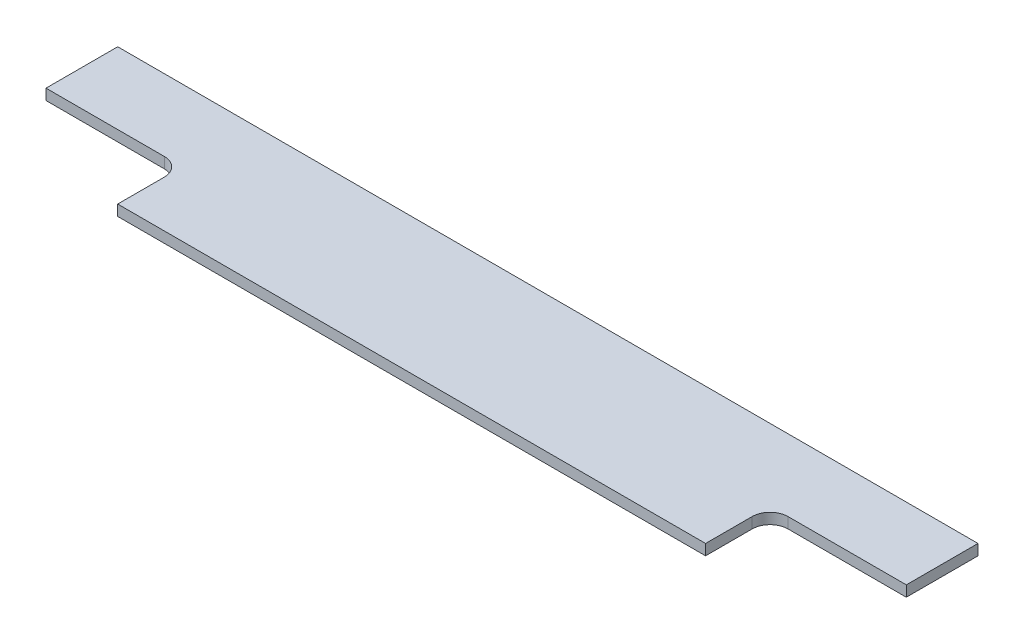
ISO-10303-21;
HEADER;
FILE_DESCRIPTION(('STEP AP214'),'2;1');
FILE_NAME('part.step','',(''),(''),'','','');
FILE_SCHEMA(('AUTOMOTIVE_DESIGN { 1 0 10303 214 1 1 1 1 }'));
ENDSEC;
DATA;
#1=APPLICATION_CONTEXT('core data for automotive mechanical design processes');
#2=APPLICATION_PROTOCOL_DEFINITION('international standard','automotive_design',2000,#1);
#3=PRODUCT_CONTEXT('',#1,'mechanical');
#4=PRODUCT('Part','Part','',(#3));
#5=PRODUCT_RELATED_PRODUCT_CATEGORY('part','',(#4));
#6=PRODUCT_DEFINITION_FORMATION('','',#4);
#7=PRODUCT_DEFINITION_CONTEXT('part definition',#1,'design');
#8=PRODUCT_DEFINITION('design','',#6,#7);
#9=PRODUCT_DEFINITION_SHAPE('','',#8);
#10=(LENGTH_UNIT() NAMED_UNIT(*) SI_UNIT(.MILLI.,.METRE.));
#11=(NAMED_UNIT(*) PLANE_ANGLE_UNIT() SI_UNIT($,.RADIAN.));
#12=(NAMED_UNIT(*) SI_UNIT($,.STERADIAN.) SOLID_ANGLE_UNIT());
#13=UNCERTAINTY_MEASURE_WITH_UNIT(LENGTH_MEASURE(1.E-05),#10,'distance_accuracy_value','');
#14=(GEOMETRIC_REPRESENTATION_CONTEXT(3) GLOBAL_UNCERTAINTY_ASSIGNED_CONTEXT((#13)) GLOBAL_UNIT_ASSIGNED_CONTEXT((#10,
#11,#12)) REPRESENTATION_CONTEXT('',''));
#15=CARTESIAN_POINT('',(0.,0.,0.));
#16=DIRECTION('',(0.,0.,1.));
#17=DIRECTION('',(1.,0.,0.));
#18=AXIS2_PLACEMENT_3D('',#15,#16,#17);
#19=CARTESIAN_POINT('',(120.,3.,-19.));
#20=DIRECTION('',(-1.,0.,0.));
#21=DIRECTION('',(0.,0.,1.));
#22=AXIS2_PLACEMENT_3D('',#19,#20,#21);
#23=PLANE('',#22);
#24=DIRECTION('',(0.,0.,-1.));
#25=VECTOR('',#24,1.);
#26=CARTESIAN_POINT('',(120.,3.,-19.));
#27=LINE('',#26,#25);
#28=CARTESIAN_POINT('',(120.,3.,0.999999999999994));
#29=VERTEX_POINT('',#28);
#30=CARTESIAN_POINT('',(120.,3.,-19.));
#31=VERTEX_POINT('',#30);
#32=EDGE_CURVE('E130',#29,#31,#27,.T.);
#33=ORIENTED_EDGE('',*,*,#32,.F.);
#34=DIRECTION('',(0.,1.,0.));
#35=VECTOR('',#34,1.);
#36=CARTESIAN_POINT('',(120.,0.,0.999999999999994));
#37=LINE('',#36,#35);
#38=CARTESIAN_POINT('',(120.,0.,0.999999999999994));
#39=VERTEX_POINT('',#38);
#40=EDGE_CURVE('E169',#39,#29,#37,.T.);
#41=ORIENTED_EDGE('',*,*,#40,.F.);
#42=DIRECTION('',(0.,0.,-1.));
#43=VECTOR('',#42,1.);
#44=CARTESIAN_POINT('',(120.,0.,-19.));
#45=LINE('',#44,#43);
#46=CARTESIAN_POINT('',(120.,0.,-19.));
#47=VERTEX_POINT('',#46);
#48=EDGE_CURVE('E193',#39,#47,#45,.T.);
#49=ORIENTED_EDGE('',*,*,#48,.T.);
#50=DIRECTION('',(0.,-1.,0.));
#51=VECTOR('',#50,1.);
#52=CARTESIAN_POINT('',(120.,3.,-19.));
#53=LINE('',#52,#51);
#54=EDGE_CURVE('E143',#31,#47,#53,.T.);
#55=ORIENTED_EDGE('',*,*,#54,.F.);
#56=EDGE_LOOP('',(#33,#41,#49,#55));
#57=FACE_BOUND('',#56,.T.);
#58=ADVANCED_FACE('F33',(#57),#23,.F.);
#59=CARTESIAN_POINT('',(-120.,3.,-19.));
#60=DIRECTION('',(0.,0.,1.));
#61=DIRECTION('',(1.,0.,0.));
#62=AXIS2_PLACEMENT_3D('',#59,#60,#61);
#63=PLANE('',#62);
#64=DIRECTION('',(-1.,0.,0.));
#65=VECTOR('',#64,1.);
#66=CARTESIAN_POINT('',(-120.,0.,-19.));
#67=LINE('',#66,#65);
#68=CARTESIAN_POINT('',(-120.,0.,-19.));
#69=VERTEX_POINT('',#68);
#70=EDGE_CURVE('E136',#47,#69,#67,.T.);
#71=ORIENTED_EDGE('',*,*,#70,.T.);
#72=DIRECTION('',(0.,-1.,0.));
#73=VECTOR('',#72,1.);
#74=CARTESIAN_POINT('',(-120.,3.,-19.));
#75=LINE('',#74,#73);
#76=CARTESIAN_POINT('',(-120.,3.,-19.));
#77=VERTEX_POINT('',#76);
#78=EDGE_CURVE('E140',#77,#69,#75,.T.);
#79=ORIENTED_EDGE('',*,*,#78,.F.);
#80=DIRECTION('',(-1.,0.,0.));
#81=VECTOR('',#80,1.);
#82=CARTESIAN_POINT('',(-120.,3.,-19.));
#83=LINE('',#82,#81);
#84=EDGE_CURVE('E133',#31,#77,#83,.T.);
#85=ORIENTED_EDGE('',*,*,#84,.F.);
#86=ORIENTED_EDGE('',*,*,#54,.T.);
#87=EDGE_LOOP('',(#71,#79,#85,#86));
#88=FACE_BOUND('',#87,.T.);
#89=ADVANCED_FACE('F197',(#88),#63,.F.);
#90=CARTESIAN_POINT('',(-120.,3.,-19.));
#91=DIRECTION('',(1.,0.,0.));
#92=DIRECTION('',(0.,0.,-1.));
#93=AXIS2_PLACEMENT_3D('',#90,#91,#92);
#94=PLANE('',#93);
#95=DIRECTION('',(0.,0.,1.));
#96=VECTOR('',#95,1.);
#97=CARTESIAN_POINT('',(-120.,0.,-19.));
#98=LINE('',#97,#96);
#99=CARTESIAN_POINT('',(-120.,0.,1.));
#100=VERTEX_POINT('',#99);
#101=EDGE_CURVE('E131',#69,#100,#98,.T.);
#102=ORIENTED_EDGE('',*,*,#101,.T.);
#103=DIRECTION('',(0.,1.,0.));
#104=VECTOR('',#103,1.);
#105=CARTESIAN_POINT('',(-120.,0.,1.));
#106=LINE('',#105,#104);
#107=CARTESIAN_POINT('',(-120.,3.,1.));
#108=VERTEX_POINT('',#107);
#109=EDGE_CURVE('E124',#100,#108,#106,.T.);
#110=ORIENTED_EDGE('',*,*,#109,.T.);
#111=DIRECTION('',(0.,0.,1.));
#112=VECTOR('',#111,1.);
#113=CARTESIAN_POINT('',(-120.,3.,-19.));
#114=LINE('',#113,#112);
#115=EDGE_CURVE('E189',#77,#108,#114,.T.);
#116=ORIENTED_EDGE('',*,*,#115,.F.);
#117=ORIENTED_EDGE('',*,*,#78,.T.);
#118=EDGE_LOOP('',(#102,#110,#116,#117));
#119=FACE_BOUND('',#118,.T.);
#120=ADVANCED_FACE('F203',(#119),#94,.F.);
#121=CARTESIAN_POINT('',(-120.,3.,19.));
#122=DIRECTION('',(0.,0.,-1.));
#123=DIRECTION('',(-1.,0.,0.));
#124=AXIS2_PLACEMENT_3D('',#121,#122,#123);
#125=PLANE('',#124);
#126=DIRECTION('',(1.,0.,0.));
#127=VECTOR('',#126,1.);
#128=CARTESIAN_POINT('',(-120.,3.,19.));
#129=LINE('',#128,#127);
#130=CARTESIAN_POINT('',(-82.,3.,19.));
#131=VERTEX_POINT('',#130);
#132=CARTESIAN_POINT('',(82.,3.,19.));
#133=VERTEX_POINT('',#132);
#134=EDGE_CURVE('E123',#131,#133,#129,.T.);
#135=ORIENTED_EDGE('',*,*,#134,.F.);
#136=DIRECTION('',(0.,1.,0.));
#137=VECTOR('',#136,1.);
#138=CARTESIAN_POINT('',(-82.,0.,19.));
#139=LINE('',#138,#137);
#140=CARTESIAN_POINT('',(-82.,0.,19.));
#141=VERTEX_POINT('',#140);
#142=EDGE_CURVE('E109',#141,#131,#139,.T.);
#143=ORIENTED_EDGE('',*,*,#142,.F.);
#144=DIRECTION('',(1.,0.,0.));
#145=VECTOR('',#144,1.);
#146=CARTESIAN_POINT('',(-120.,0.,19.));
#147=LINE('',#146,#145);
#148=CARTESIAN_POINT('',(82.,0.,19.));
#149=VERTEX_POINT('',#148);
#150=EDGE_CURVE('E121',#141,#149,#147,.T.);
#151=ORIENTED_EDGE('',*,*,#150,.T.);
#152=DIRECTION('',(0.,1.,0.));
#153=VECTOR('',#152,1.);
#154=CARTESIAN_POINT('',(82.,0.,19.));
#155=LINE('',#154,#153);
#156=EDGE_CURVE('E168',#149,#133,#155,.T.);
#157=ORIENTED_EDGE('',*,*,#156,.T.);
#158=EDGE_LOOP('',(#135,#143,#151,#157));
#159=FACE_BOUND('',#158,.T.);
#160=ADVANCED_FACE('F119',(#159),#125,.F.);
#161=CARTESIAN_POINT('',(0.,3.,0.));
#162=DIRECTION('',(0.,1.,0.));
#163=DIRECTION('',(0.,0.,1.));
#164=AXIS2_PLACEMENT_3D('',#161,#162,#163);
#165=PLANE('',#164);
#166=DIRECTION('',(-1.,0.,0.));
#167=VECTOR('',#166,1.);
#168=CARTESIAN_POINT('',(-120.,3.,1.));
#169=LINE('',#168,#167);
#170=CARTESIAN_POINT('',(-87.,3.,0.999999999999997));
#171=VERTEX_POINT('',#170);
#172=EDGE_CURVE('E114',#171,#108,#169,.T.);
#173=ORIENTED_EDGE('',*,*,#172,.F.);
#174=CARTESIAN_POINT('',(-87.,3.,6.));
#175=DIRECTION('',(0.,1.,0.));
#176=DIRECTION('',(0.,0.,1.));
#177=AXIS2_PLACEMENT_3D('',#174,#175,#176);
#178=CIRCLE('',#177,5.);
#179=CARTESIAN_POINT('',(-82.,3.,6.));
#180=VERTEX_POINT('',#179);
#181=EDGE_CURVE('E41',#171,#180,#178,.F.);
#182=ORIENTED_EDGE('',*,*,#181,.T.);
#183=DIRECTION('',(0.,0.,-1.));
#184=VECTOR('',#183,1.);
#185=CARTESIAN_POINT('',(-82.,3.,19.));
#186=LINE('',#185,#184);
#187=EDGE_CURVE('E186',#131,#180,#186,.T.);
#188=ORIENTED_EDGE('',*,*,#187,.F.);
#189=ORIENTED_EDGE('',*,*,#134,.T.);
#190=DIRECTION('',(0.,0.,1.));
#191=VECTOR('',#190,1.);
#192=CARTESIAN_POINT('',(82.,3.,19.));
#193=LINE('',#192,#191);
#194=CARTESIAN_POINT('',(82.,3.,6.00000000000002));
#195=VERTEX_POINT('',#194);
#196=EDGE_CURVE('E177',#195,#133,#193,.T.);
#197=ORIENTED_EDGE('',*,*,#196,.F.);
#198=CARTESIAN_POINT('',(87.,3.,6.00000000000002));
#199=DIRECTION('',(0.,1.,0.));
#200=DIRECTION('',(0.,0.,1.));
#201=AXIS2_PLACEMENT_3D('',#198,#199,#200);
#202=CIRCLE('',#201,5.);
#203=CARTESIAN_POINT('',(87.,3.,1.00000000000001));
#204=VERTEX_POINT('',#203);
#205=EDGE_CURVE('E155',#195,#204,#202,.F.);
#206=ORIENTED_EDGE('',*,*,#205,.T.);
#207=DIRECTION('',(-1.,0.,0.));
#208=VECTOR('',#207,1.);
#209=CARTESIAN_POINT('',(120.,3.,0.999999999999994));
#210=LINE('',#209,#208);
#211=EDGE_CURVE('E175',#29,#204,#210,.T.);
#212=ORIENTED_EDGE('',*,*,#211,.F.);
#213=ORIENTED_EDGE('',*,*,#32,.T.);
#214=ORIENTED_EDGE('',*,*,#84,.T.);
#215=ORIENTED_EDGE('',*,*,#115,.T.);
#216=EDGE_LOOP('',(#173,#182,#188,#189,#197,#206,#212,#213,#214,#215));
#217=FACE_BOUND('',#216,.T.);
#218=ADVANCED_FACE('F174',(#217),#165,.T.);
#219=CARTESIAN_POINT('',(0.,0.,0.));
#220=DIRECTION('',(0.,1.,0.));
#221=DIRECTION('',(0.,0.,1.));
#222=AXIS2_PLACEMENT_3D('',#219,#220,#221);
#223=PLANE('',#222);
#224=DIRECTION('',(0.,0.,-1.));
#225=VECTOR('',#224,1.);
#226=CARTESIAN_POINT('',(-82.,0.,19.));
#227=LINE('',#226,#225);
#228=CARTESIAN_POINT('',(-82.,0.,6.));
#229=VERTEX_POINT('',#228);
#230=EDGE_CURVE('E106',#141,#229,#227,.T.);
#231=ORIENTED_EDGE('',*,*,#230,.T.);
#232=CARTESIAN_POINT('',(-87.,0.,6.));
#233=DIRECTION('',(0.,1.,0.));
#234=DIRECTION('',(0.,0.,1.));
#235=AXIS2_PLACEMENT_3D('',#232,#233,#234);
#236=CIRCLE('',#235,5.);
#237=CARTESIAN_POINT('',(-87.,0.,0.999999999999997));
#238=VERTEX_POINT('',#237);
#239=EDGE_CURVE('E11',#229,#238,#236,.T.);
#240=ORIENTED_EDGE('',*,*,#239,.T.);
#241=DIRECTION('',(-1.,0.,0.));
#242=VECTOR('',#241,1.);
#243=CARTESIAN_POINT('',(-120.,0.,1.));
#244=LINE('',#243,#242);
#245=EDGE_CURVE('E113',#238,#100,#244,.T.);
#246=ORIENTED_EDGE('',*,*,#245,.T.);
#247=ORIENTED_EDGE('',*,*,#101,.F.);
#248=ORIENTED_EDGE('',*,*,#70,.F.);
#249=ORIENTED_EDGE('',*,*,#48,.F.);
#250=DIRECTION('',(-1.,0.,0.));
#251=VECTOR('',#250,1.);
#252=CARTESIAN_POINT('',(120.,0.,0.999999999999994));
#253=LINE('',#252,#251);
#254=CARTESIAN_POINT('',(87.,0.,1.00000000000001));
#255=VERTEX_POINT('',#254);
#256=EDGE_CURVE('E161',#39,#255,#253,.T.);
#257=ORIENTED_EDGE('',*,*,#256,.T.);
#258=CARTESIAN_POINT('',(87.,0.,6.00000000000002));
#259=DIRECTION('',(0.,1.,0.));
#260=DIRECTION('',(0.,0.,1.));
#261=AXIS2_PLACEMENT_3D('',#258,#259,#260);
#262=CIRCLE('',#261,5.);
#263=CARTESIAN_POINT('',(82.,0.,6.00000000000002));
#264=VERTEX_POINT('',#263);
#265=EDGE_CURVE('E157',#255,#264,#262,.T.);
#266=ORIENTED_EDGE('',*,*,#265,.T.);
#267=DIRECTION('',(0.,0.,1.));
#268=VECTOR('',#267,1.);
#269=CARTESIAN_POINT('',(82.,0.,19.));
#270=LINE('',#269,#268);
#271=EDGE_CURVE('E128',#264,#149,#270,.T.);
#272=ORIENTED_EDGE('',*,*,#271,.T.);
#273=ORIENTED_EDGE('',*,*,#150,.F.);
#274=EDGE_LOOP('',(#231,#240,#246,#247,#248,#249,#257,#266,#272,#273));
#275=FACE_BOUND('',#274,.T.);
#276=ADVANCED_FACE('F126',(#275),#223,.F.);
#277=CARTESIAN_POINT('',(82.,0.,19.));
#278=DIRECTION('',(-1.,0.,0.));
#279=DIRECTION('',(0.,0.,1.));
#280=AXIS2_PLACEMENT_3D('',#277,#278,#279);
#281=PLANE('',#280);
#282=ORIENTED_EDGE('',*,*,#271,.F.);
#283=DIRECTION('',(0.,1.,0.));
#284=VECTOR('',#283,1.);
#285=CARTESIAN_POINT('',(82.,3.,6.00000000000002));
#286=LINE('',#285,#284);
#287=EDGE_CURVE('E146',#264,#195,#286,.T.);
#288=ORIENTED_EDGE('',*,*,#287,.T.);
#289=ORIENTED_EDGE('',*,*,#196,.T.);
#290=ORIENTED_EDGE('',*,*,#156,.F.);
#291=EDGE_LOOP('',(#282,#288,#289,#290));
#292=FACE_BOUND('',#291,.T.);
#293=ADVANCED_FACE('F166',(#292),#281,.F.);
#294=CARTESIAN_POINT('',(120.,0.,0.999999999999994));
#295=DIRECTION('',(0.,0.,-1.));
#296=DIRECTION('',(-1.,0.,0.));
#297=AXIS2_PLACEMENT_3D('',#294,#295,#296);
#298=PLANE('',#297);
#299=ORIENTED_EDGE('',*,*,#211,.T.);
#300=DIRECTION('',(0.,1.,0.));
#301=VECTOR('',#300,1.);
#302=CARTESIAN_POINT('',(87.,0.,1.00000000000001));
#303=LINE('',#302,#301);
#304=EDGE_CURVE('E149',#204,#255,#303,.F.);
#305=ORIENTED_EDGE('',*,*,#304,.T.);
#306=ORIENTED_EDGE('',*,*,#256,.F.);
#307=ORIENTED_EDGE('',*,*,#40,.T.);
#308=EDGE_LOOP('',(#299,#305,#306,#307));
#309=FACE_BOUND('',#308,.T.);
#310=ADVANCED_FACE('F179',(#309),#298,.F.);
#311=CARTESIAN_POINT('',(-120.,0.,1.));
#312=DIRECTION('',(0.,0.,-1.));
#313=DIRECTION('',(-1.,0.,0.));
#314=AXIS2_PLACEMENT_3D('',#311,#312,#313);
#315=PLANE('',#314);
#316=ORIENTED_EDGE('',*,*,#245,.F.);
#317=DIRECTION('',(0.,1.,0.));
#318=VECTOR('',#317,1.);
#319=CARTESIAN_POINT('',(-87.,3.,0.999999999999997));
#320=LINE('',#319,#318);
#321=EDGE_CURVE('E151',#238,#171,#320,.T.);
#322=ORIENTED_EDGE('',*,*,#321,.T.);
#323=ORIENTED_EDGE('',*,*,#172,.T.);
#324=ORIENTED_EDGE('',*,*,#109,.F.);
#325=EDGE_LOOP('',(#316,#322,#323,#324));
#326=FACE_BOUND('',#325,.T.);
#327=ADVANCED_FACE('F210',(#326),#315,.F.);
#328=CARTESIAN_POINT('',(-82.,0.,19.));
#329=DIRECTION('',(1.,0.,0.));
#330=DIRECTION('',(0.,0.,-1.));
#331=AXIS2_PLACEMENT_3D('',#328,#329,#330);
#332=PLANE('',#331);
#333=ORIENTED_EDGE('',*,*,#187,.T.);
#334=DIRECTION('',(0.,1.,0.));
#335=VECTOR('',#334,1.);
#336=CARTESIAN_POINT('',(-82.,0.,6.));
#337=LINE('',#336,#335);
#338=EDGE_CURVE('E48',#180,#229,#337,.F.);
#339=ORIENTED_EDGE('',*,*,#338,.T.);
#340=ORIENTED_EDGE('',*,*,#230,.F.);
#341=ORIENTED_EDGE('',*,*,#142,.T.);
#342=EDGE_LOOP('',(#333,#339,#340,#341));
#343=FACE_BOUND('',#342,.T.);
#344=ADVANCED_FACE('F108',(#343),#332,.F.);
#345=CARTESIAN_POINT('',(87.,0.,6.00000000000002));
#346=DIRECTION('',(0.,-1.,0.));
#347=DIRECTION('',(0.,0.,-1.));
#348=AXIS2_PLACEMENT_3D('',#345,#346,#347);
#349=CYLINDRICAL_SURFACE('',#348,5.);
#350=ORIENTED_EDGE('',*,*,#265,.F.);
#351=ORIENTED_EDGE('',*,*,#304,.F.);
#352=ORIENTED_EDGE('',*,*,#205,.F.);
#353=ORIENTED_EDGE('',*,*,#287,.F.);
#354=EDGE_LOOP('',(#350,#351,#352,#353));
#355=FACE_BOUND('',#354,.T.);
#356=ADVANCED_FACE('F171',(#355),#349,.F.);
#357=CARTESIAN_POINT('',(-87.,0.,6.));
#358=DIRECTION('',(0.,-1.,0.));
#359=DIRECTION('',(0.,0.,-1.));
#360=AXIS2_PLACEMENT_3D('',#357,#358,#359);
#361=CYLINDRICAL_SURFACE('',#360,5.);
#362=ORIENTED_EDGE('',*,*,#239,.F.);
#363=ORIENTED_EDGE('',*,*,#338,.F.);
#364=ORIENTED_EDGE('',*,*,#181,.F.);
#365=ORIENTED_EDGE('',*,*,#321,.F.);
#366=EDGE_LOOP('',(#362,#363,#364,#365));
#367=FACE_BOUND('',#366,.T.);
#368=ADVANCED_FACE('F35',(#367),#361,.F.);
#369=CLOSED_SHELL('',(#58,#89,#120,#160,#218,#276,#293,#310,#327,#344,#356,#368));
#370=MANIFOLD_SOLID_BREP('B2',#369);
#371=ADVANCED_BREP_SHAPE_REPRESENTATION('',(#18,#370),#14);
#372=SHAPE_DEFINITION_REPRESENTATION(#9,#371);
ENDSEC;
END-ISO-10303-21;
